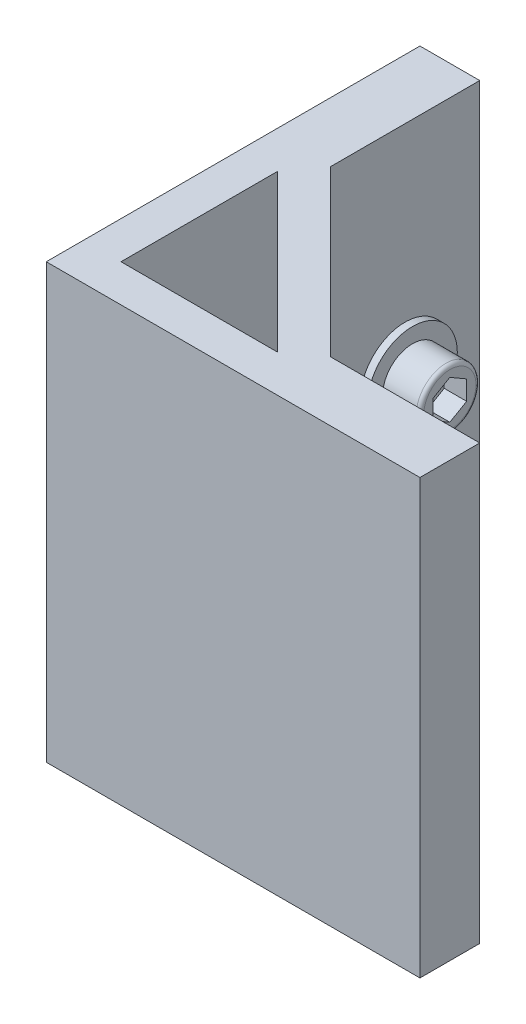
ISO-10303-21;
HEADER;
FILE_DESCRIPTION(('STEP AP214'),'2;1');
FILE_NAME('part.step','',(''),(''),'','','');
FILE_SCHEMA(('AUTOMOTIVE_DESIGN { 1 0 10303 214 1 1 1 1 }'));
ENDSEC;
DATA;
#1=APPLICATION_CONTEXT('core data for automotive mechanical design processes');
#2=APPLICATION_PROTOCOL_DEFINITION('international standard','automotive_design',2000,#1);
#3=PRODUCT_CONTEXT('',#1,'mechanical');
#4=PRODUCT('Part','Part','',(#3));
#5=PRODUCT_RELATED_PRODUCT_CATEGORY('part','',(#4));
#6=PRODUCT_DEFINITION_FORMATION('','',#4);
#7=PRODUCT_DEFINITION_CONTEXT('part definition',#1,'design');
#8=PRODUCT_DEFINITION('design','',#6,#7);
#9=PRODUCT_DEFINITION_SHAPE('','',#8);
#10=(LENGTH_UNIT() NAMED_UNIT(*) SI_UNIT(.MILLI.,.METRE.));
#11=(NAMED_UNIT(*) PLANE_ANGLE_UNIT() SI_UNIT($,.RADIAN.));
#12=(NAMED_UNIT(*) SI_UNIT($,.STERADIAN.) SOLID_ANGLE_UNIT());
#13=UNCERTAINTY_MEASURE_WITH_UNIT(LENGTH_MEASURE(1.E-05),#10,'distance_accuracy_value','');
#14=(GEOMETRIC_REPRESENTATION_CONTEXT(3) GLOBAL_UNCERTAINTY_ASSIGNED_CONTEXT((#13)) GLOBAL_UNIT_ASSIGNED_CONTEXT((#10,
#11,#12)) REPRESENTATION_CONTEXT('',''));
#15=CARTESIAN_POINT('',(0.,0.,0.));
#16=DIRECTION('',(0.,0.,1.));
#17=DIRECTION('',(1.,0.,0.));
#18=AXIS2_PLACEMENT_3D('',#15,#16,#17);
#19=CARTESIAN_POINT('',(0.,58.,0.));
#20=DIRECTION('',(0.,1.,0.));
#21=DIRECTION('',(0.,0.,1.));
#22=AXIS2_PLACEMENT_3D('',#19,#20,#21);
#23=PLANE('',#22);
#24=DIRECTION('',(-1.,0.,0.));
#25=VECTOR('',#24,1.);
#26=CARTESIAN_POINT('',(8.,58.,-50.));
#27=LINE('',#26,#25);
#28=CARTESIAN_POINT('',(8.,58.,-50.));
#29=VERTEX_POINT('',#28);
#30=CARTESIAN_POINT('',(0.,58.,-50.));
#31=VERTEX_POINT('',#30);
#32=EDGE_CURVE('E230',#29,#31,#27,.T.);
#33=ORIENTED_EDGE('',*,*,#32,.T.);
#34=DIRECTION('',(0.,0.,1.));
#35=VECTOR('',#34,1.);
#36=CARTESIAN_POINT('',(0.,58.,-50.));
#37=LINE('',#36,#35);
#38=CARTESIAN_POINT('',(0.,58.,0.));
#39=VERTEX_POINT('',#38);
#40=EDGE_CURVE('E233',#31,#39,#37,.T.);
#41=ORIENTED_EDGE('',*,*,#40,.T.);
#42=DIRECTION('',(1.,0.,0.));
#43=VECTOR('',#42,1.);
#44=CARTESIAN_POINT('',(0.,58.,0.));
#45=LINE('',#44,#43);
#46=CARTESIAN_POINT('',(50.,58.,0.));
#47=VERTEX_POINT('',#46);
#48=EDGE_CURVE('E236',#39,#47,#45,.T.);
#49=ORIENTED_EDGE('',*,*,#48,.T.);
#50=DIRECTION('',(0.,0.,-1.));
#51=VECTOR('',#50,1.);
#52=CARTESIAN_POINT('',(50.,58.,0.));
#53=LINE('',#52,#51);
#54=CARTESIAN_POINT('',(50.,58.,-8.));
#55=VERTEX_POINT('',#54);
#56=EDGE_CURVE('E238',#47,#55,#53,.T.);
#57=ORIENTED_EDGE('',*,*,#56,.T.);
#58=DIRECTION('',(-1.,0.,0.));
#59=VECTOR('',#58,1.);
#60=CARTESIAN_POINT('',(50.,58.,-8.));
#61=LINE('',#60,#59);
#62=CARTESIAN_POINT('',(30.,58.,-8.));
#63=VERTEX_POINT('',#62);
#64=EDGE_CURVE('E240',#55,#63,#61,.T.);
#65=ORIENTED_EDGE('',*,*,#64,.T.);
#66=DIRECTION('',(-0.707106781186548,0.,-0.707106781186548));
#67=VECTOR('',#66,1.);
#68=CARTESIAN_POINT('',(30.,58.,-8.));
#69=LINE('',#68,#67);
#70=CARTESIAN_POINT('',(8.,58.,-30.));
#71=VERTEX_POINT('',#70);
#72=EDGE_CURVE('E242',#63,#71,#69,.T.);
#73=ORIENTED_EDGE('',*,*,#72,.T.);
#74=DIRECTION('',(0.,0.,-1.));
#75=VECTOR('',#74,1.);
#76=CARTESIAN_POINT('',(8.,58.,-30.));
#77=LINE('',#76,#75);
#78=EDGE_CURVE('E244',#71,#29,#77,.T.);
#79=ORIENTED_EDGE('',*,*,#78,.T.);
#80=EDGE_LOOP('',(#33,#41,#49,#57,#65,#73,#79));
#81=FACE_BOUND('',#80,.T.);
#82=DIRECTION('',(1.,0.,0.));
#83=VECTOR('',#82,1.);
#84=CARTESIAN_POINT('',(25.9289321881345,58.,-5.));
#85=LINE('',#84,#83);
#86=CARTESIAN_POINT('',(5.,58.,-5.));
#87=VERTEX_POINT('',#86);
#88=CARTESIAN_POINT('',(25.9289321881345,58.,-5.));
#89=VERTEX_POINT('',#88);
#90=EDGE_CURVE('E210',#87,#89,#85,.T.);
#91=ORIENTED_EDGE('',*,*,#90,.F.);
#92=DIRECTION('',(0.,0.,1.));
#93=VECTOR('',#92,1.);
#94=CARTESIAN_POINT('',(5.,58.,-5.));
#95=LINE('',#94,#93);
#96=CARTESIAN_POINT('',(5.00000000000001,58.,-25.9289321881345));
#97=VERTEX_POINT('',#96);
#98=EDGE_CURVE('E208',#97,#87,#95,.T.);
#99=ORIENTED_EDGE('',*,*,#98,.F.);
#100=DIRECTION('',(-0.707106781186547,0.,-0.707106781186548));
#101=VECTOR('',#100,1.);
#102=CARTESIAN_POINT('',(5.00000000000001,58.,-25.9289321881345));
#103=LINE('',#102,#101);
#104=EDGE_CURVE('E213',#89,#97,#103,.T.);
#105=ORIENTED_EDGE('',*,*,#104,.F.);
#106=EDGE_LOOP('',(#91,#99,#105));
#107=FACE_BOUND('',#106,.T.);
#108=ADVANCED_FACE('F33',(#81,#107),#23,.T.);
#109=CARTESIAN_POINT('',(0.,0.,0.));
#110=DIRECTION('',(0.,1.,0.));
#111=DIRECTION('',(0.,0.,1.));
#112=AXIS2_PLACEMENT_3D('',#109,#110,#111);
#113=PLANE('',#112);
#114=DIRECTION('',(-1.,0.,0.));
#115=VECTOR('',#114,1.);
#116=CARTESIAN_POINT('',(8.,0.,-50.));
#117=LINE('',#116,#115);
#118=CARTESIAN_POINT('',(8.,0.,-50.));
#119=VERTEX_POINT('',#118);
#120=CARTESIAN_POINT('',(0.,0.,-50.));
#121=VERTEX_POINT('',#120);
#122=EDGE_CURVE('E229',#119,#121,#117,.T.);
#123=ORIENTED_EDGE('',*,*,#122,.F.);
#124=DIRECTION('',(0.,0.,-1.));
#125=VECTOR('',#124,1.);
#126=CARTESIAN_POINT('',(8.,0.,-30.));
#127=LINE('',#126,#125);
#128=CARTESIAN_POINT('',(8.,0.,-30.));
#129=VERTEX_POINT('',#128);
#130=EDGE_CURVE('E234',#129,#119,#127,.T.);
#131=ORIENTED_EDGE('',*,*,#130,.F.);
#132=DIRECTION('',(-0.707106781186548,0.,-0.707106781186548));
#133=VECTOR('',#132,1.);
#134=CARTESIAN_POINT('',(30.,0.,-8.));
#135=LINE('',#134,#133);
#136=CARTESIAN_POINT('',(30.,0.,-8.));
#137=VERTEX_POINT('',#136);
#138=EDGE_CURVE('E257',#137,#129,#135,.T.);
#139=ORIENTED_EDGE('',*,*,#138,.F.);
#140=DIRECTION('',(-1.,0.,0.));
#141=VECTOR('',#140,1.);
#142=CARTESIAN_POINT('',(50.,0.,-8.));
#143=LINE('',#142,#141);
#144=CARTESIAN_POINT('',(50.,0.,-8.));
#145=VERTEX_POINT('',#144);
#146=EDGE_CURVE('E255',#145,#137,#143,.T.);
#147=ORIENTED_EDGE('',*,*,#146,.F.);
#148=DIRECTION('',(0.,0.,-1.));
#149=VECTOR('',#148,1.);
#150=CARTESIAN_POINT('',(50.,0.,0.));
#151=LINE('',#150,#149);
#152=CARTESIAN_POINT('',(50.,0.,0.));
#153=VERTEX_POINT('',#152);
#154=EDGE_CURVE('E253',#153,#145,#151,.T.);
#155=ORIENTED_EDGE('',*,*,#154,.F.);
#156=DIRECTION('',(1.,0.,0.));
#157=VECTOR('',#156,1.);
#158=CARTESIAN_POINT('',(0.,0.,0.));
#159=LINE('',#158,#157);
#160=CARTESIAN_POINT('',(0.,0.,0.));
#161=VERTEX_POINT('',#160);
#162=EDGE_CURVE('E251',#161,#153,#159,.T.);
#163=ORIENTED_EDGE('',*,*,#162,.F.);
#164=DIRECTION('',(0.,0.,1.));
#165=VECTOR('',#164,1.);
#166=CARTESIAN_POINT('',(0.,0.,-50.));
#167=LINE('',#166,#165);
#168=EDGE_CURVE('E249',#121,#161,#167,.T.);
#169=ORIENTED_EDGE('',*,*,#168,.F.);
#170=EDGE_LOOP('',(#123,#131,#139,#147,#155,#163,#169));
#171=FACE_BOUND('',#170,.T.);
#172=DIRECTION('',(0.,0.,1.));
#173=VECTOR('',#172,1.);
#174=CARTESIAN_POINT('',(5.,0.,-5.));
#175=LINE('',#174,#173);
#176=CARTESIAN_POINT('',(5.00000000000001,0.,-25.9289321881345));
#177=VERTEX_POINT('',#176);
#178=CARTESIAN_POINT('',(5.,0.,-5.));
#179=VERTEX_POINT('',#178);
#180=EDGE_CURVE('E207',#177,#179,#175,.T.);
#181=ORIENTED_EDGE('',*,*,#180,.T.);
#182=DIRECTION('',(1.,0.,0.));
#183=VECTOR('',#182,1.);
#184=CARTESIAN_POINT('',(25.9289321881345,0.,-5.));
#185=LINE('',#184,#183);
#186=CARTESIAN_POINT('',(25.9289321881345,0.,-5.));
#187=VERTEX_POINT('',#186);
#188=EDGE_CURVE('E218',#179,#187,#185,.T.);
#189=ORIENTED_EDGE('',*,*,#188,.T.);
#190=DIRECTION('',(-0.707106781186547,0.,-0.707106781186548));
#191=VECTOR('',#190,1.);
#192=CARTESIAN_POINT('',(5.00000000000001,0.,-25.9289321881345));
#193=LINE('',#192,#191);
#194=EDGE_CURVE('E211',#187,#177,#193,.T.);
#195=ORIENTED_EDGE('',*,*,#194,.T.);
#196=EDGE_LOOP('',(#181,#189,#195));
#197=FACE_BOUND('',#196,.T.);
#198=ADVANCED_FACE('F295',(#171,#197),#113,.F.);
#199=CARTESIAN_POINT('',(8.,58.,-50.));
#200=DIRECTION('',(0.,0.,1.));
#201=DIRECTION('',(1.,0.,0.));
#202=AXIS2_PLACEMENT_3D('',#199,#200,#201);
#203=PLANE('',#202);
#204=ORIENTED_EDGE('',*,*,#122,.T.);
#205=DIRECTION('',(0.,-1.,0.));
#206=VECTOR('',#205,1.);
#207=CARTESIAN_POINT('',(0.,58.,-50.));
#208=LINE('',#207,#206);
#209=EDGE_CURVE('E277',#31,#121,#208,.T.);
#210=ORIENTED_EDGE('',*,*,#209,.F.);
#211=ORIENTED_EDGE('',*,*,#32,.F.);
#212=DIRECTION('',(0.,-1.,0.));
#213=VECTOR('',#212,1.);
#214=CARTESIAN_POINT('',(8.,58.,-50.));
#215=LINE('',#214,#213);
#216=EDGE_CURVE('E246',#29,#119,#215,.T.);
#217=ORIENTED_EDGE('',*,*,#216,.T.);
#218=EDGE_LOOP('',(#204,#210,#211,#217));
#219=FACE_BOUND('',#218,.T.);
#220=ADVANCED_FACE('F301',(#219),#203,.F.);
#221=CARTESIAN_POINT('',(0.,58.,-50.));
#222=DIRECTION('',(1.,0.,0.));
#223=DIRECTION('',(0.,0.,-1.));
#224=AXIS2_PLACEMENT_3D('',#221,#222,#223);
#225=PLANE('',#224);
#226=ORIENTED_EDGE('',*,*,#168,.T.);
#227=DIRECTION('',(0.,-1.,0.));
#228=VECTOR('',#227,1.);
#229=CARTESIAN_POINT('',(0.,58.,0.));
#230=LINE('',#229,#228);
#231=EDGE_CURVE('E274',#39,#161,#230,.T.);
#232=ORIENTED_EDGE('',*,*,#231,.F.);
#233=ORIENTED_EDGE('',*,*,#40,.F.);
#234=ORIENTED_EDGE('',*,*,#209,.T.);
#235=EDGE_LOOP('',(#226,#232,#233,#234));
#236=FACE_BOUND('',#235,.T.);
#237=ADVANCED_FACE('F328',(#236),#225,.F.);
#238=CARTESIAN_POINT('',(0.,58.,0.));
#239=DIRECTION('',(0.,0.,-1.));
#240=DIRECTION('',(-1.,0.,0.));
#241=AXIS2_PLACEMENT_3D('',#238,#239,#240);
#242=PLANE('',#241);
#243=ORIENTED_EDGE('',*,*,#162,.T.);
#244=DIRECTION('',(0.,-1.,0.));
#245=VECTOR('',#244,1.);
#246=CARTESIAN_POINT('',(50.,58.,0.));
#247=LINE('',#246,#245);
#248=EDGE_CURVE('E271',#47,#153,#247,.T.);
#249=ORIENTED_EDGE('',*,*,#248,.F.);
#250=ORIENTED_EDGE('',*,*,#48,.F.);
#251=ORIENTED_EDGE('',*,*,#231,.T.);
#252=EDGE_LOOP('',(#243,#249,#250,#251));
#253=FACE_BOUND('',#252,.T.);
#254=ADVANCED_FACE('F324',(#253),#242,.F.);
#255=CARTESIAN_POINT('',(50.,58.,0.));
#256=DIRECTION('',(-1.,0.,0.));
#257=DIRECTION('',(0.,0.,1.));
#258=AXIS2_PLACEMENT_3D('',#255,#256,#257);
#259=PLANE('',#258);
#260=ORIENTED_EDGE('',*,*,#154,.T.);
#261=DIRECTION('',(0.,-1.,0.));
#262=VECTOR('',#261,1.);
#263=CARTESIAN_POINT('',(50.,58.,-8.));
#264=LINE('',#263,#262);
#265=EDGE_CURVE('E268',#55,#145,#264,.T.);
#266=ORIENTED_EDGE('',*,*,#265,.F.);
#267=ORIENTED_EDGE('',*,*,#56,.F.);
#268=ORIENTED_EDGE('',*,*,#248,.T.);
#269=EDGE_LOOP('',(#260,#266,#267,#268));
#270=FACE_BOUND('',#269,.T.);
#271=ADVANCED_FACE('F320',(#270),#259,.F.);
#272=CARTESIAN_POINT('',(50.,58.,-8.));
#273=DIRECTION('',(0.,0.,1.));
#274=DIRECTION('',(1.,0.,0.));
#275=AXIS2_PLACEMENT_3D('',#272,#273,#274);
#276=PLANE('',#275);
#277=ORIENTED_EDGE('',*,*,#146,.T.);
#278=DIRECTION('',(0.,-1.,0.));
#279=VECTOR('',#278,1.);
#280=CARTESIAN_POINT('',(30.,58.,-8.));
#281=LINE('',#280,#279);
#282=EDGE_CURVE('E265',#63,#137,#281,.T.);
#283=ORIENTED_EDGE('',*,*,#282,.F.);
#284=ORIENTED_EDGE('',*,*,#64,.F.);
#285=ORIENTED_EDGE('',*,*,#265,.T.);
#286=EDGE_LOOP('',(#277,#283,#284,#285));
#287=FACE_BOUND('',#286,.T.);
#288=ADVANCED_FACE('F316',(#287),#276,.F.);
#289=CARTESIAN_POINT('',(30.,58.,-8.));
#290=DIRECTION('',(-0.707106781186548,0.,0.707106781186548));
#291=DIRECTION('',(0.707106781186547,0.,0.707106781186548));
#292=AXIS2_PLACEMENT_3D('',#289,#290,#291);
#293=PLANE('',#292);
#294=ORIENTED_EDGE('',*,*,#138,.T.);
#295=DIRECTION('',(0.,-1.,0.));
#296=VECTOR('',#295,1.);
#297=CARTESIAN_POINT('',(8.,58.,-30.));
#298=LINE('',#297,#296);
#299=EDGE_CURVE('E262',#71,#129,#298,.T.);
#300=ORIENTED_EDGE('',*,*,#299,.F.);
#301=ORIENTED_EDGE('',*,*,#72,.F.);
#302=ORIENTED_EDGE('',*,*,#282,.T.);
#303=EDGE_LOOP('',(#294,#300,#301,#302));
#304=FACE_BOUND('',#303,.T.);
#305=ADVANCED_FACE('F312',(#304),#293,.F.);
#306=CARTESIAN_POINT('',(8.,58.,-30.));
#307=DIRECTION('',(-1.,0.,0.));
#308=DIRECTION('',(0.,0.,1.));
#309=AXIS2_PLACEMENT_3D('',#306,#307,#308);
#310=PLANE('',#309);
#311=CARTESIAN_POINT('',(8.,29.,-40.));
#312=DIRECTION('',(-1.,0.,0.));
#313=DIRECTION('',(0.,0.,1.));
#314=AXIS2_PLACEMENT_3D('',#311,#312,#313);
#315=CIRCLE('',#314,6.);
#316=CARTESIAN_POINT('',(8.,29.,-34.));
#317=VERTEX_POINT('',#316);
#318=EDGE_CURVE('E204',#317,#317,#315,.F.);
#319=ORIENTED_EDGE('',*,*,#318,.F.);
#320=EDGE_LOOP('',(#319));
#321=FACE_BOUND('',#320,.T.);
#322=ORIENTED_EDGE('',*,*,#130,.T.);
#323=ORIENTED_EDGE('',*,*,#216,.F.);
#324=ORIENTED_EDGE('',*,*,#78,.F.);
#325=ORIENTED_EDGE('',*,*,#299,.T.);
#326=EDGE_LOOP('',(#322,#323,#324,#325));
#327=FACE_BOUND('',#326,.T.);
#328=ADVANCED_FACE('F309',(#321,#327),#310,.F.);
#329=CARTESIAN_POINT('',(5.,58.,-5.));
#330=DIRECTION('',(1.,0.,0.));
#331=DIRECTION('',(0.,0.,-1.));
#332=AXIS2_PLACEMENT_3D('',#329,#330,#331);
#333=PLANE('',#332);
#334=ORIENTED_EDGE('',*,*,#180,.F.);
#335=DIRECTION('',(0.,-1.,0.));
#336=VECTOR('',#335,1.);
#337=CARTESIAN_POINT('',(5.00000000000001,58.,-25.9289321881345));
#338=LINE('',#337,#336);
#339=EDGE_CURVE('E215',#97,#177,#338,.T.);
#340=ORIENTED_EDGE('',*,*,#339,.F.);
#341=ORIENTED_EDGE('',*,*,#98,.T.);
#342=DIRECTION('',(0.,-1.,0.));
#343=VECTOR('',#342,1.);
#344=CARTESIAN_POINT('',(5.,58.,-5.));
#345=LINE('',#344,#343);
#346=EDGE_CURVE('E226',#87,#179,#345,.T.);
#347=ORIENTED_EDGE('',*,*,#346,.T.);
#348=EDGE_LOOP('',(#334,#340,#341,#347));
#349=FACE_BOUND('',#348,.T.);
#350=ADVANCED_FACE('F306',(#349),#333,.T.);
#351=CARTESIAN_POINT('',(25.9289321881345,58.,-5.));
#352=DIRECTION('',(0.,0.,-1.));
#353=DIRECTION('',(-1.,0.,0.));
#354=AXIS2_PLACEMENT_3D('',#351,#352,#353);
#355=PLANE('',#354);
#356=ORIENTED_EDGE('',*,*,#188,.F.);
#357=ORIENTED_EDGE('',*,*,#346,.F.);
#358=ORIENTED_EDGE('',*,*,#90,.T.);
#359=DIRECTION('',(0.,-1.,0.));
#360=VECTOR('',#359,1.);
#361=CARTESIAN_POINT('',(25.9289321881345,58.,-5.));
#362=LINE('',#361,#360);
#363=EDGE_CURVE('E56',#89,#187,#362,.T.);
#364=ORIENTED_EDGE('',*,*,#363,.T.);
#365=EDGE_LOOP('',(#356,#357,#358,#364));
#366=FACE_BOUND('',#365,.T.);
#367=ADVANCED_FACE('F365',(#366),#355,.T.);
#368=CARTESIAN_POINT('',(5.00000000000001,58.,-25.9289321881345));
#369=DIRECTION('',(-0.707106781186548,0.,0.707106781186547));
#370=DIRECTION('',(0.707106781186547,0.,0.707106781186548));
#371=AXIS2_PLACEMENT_3D('',#368,#369,#370);
#372=PLANE('',#371);
#373=ORIENTED_EDGE('',*,*,#194,.F.);
#374=ORIENTED_EDGE('',*,*,#363,.F.);
#375=ORIENTED_EDGE('',*,*,#104,.T.);
#376=ORIENTED_EDGE('',*,*,#339,.T.);
#377=EDGE_LOOP('',(#373,#374,#375,#376));
#378=FACE_BOUND('',#377,.T.);
#379=ADVANCED_FACE('F361',(#378),#372,.T.);
#380=CARTESIAN_POINT('',(9.,29.,-40.));
#381=DIRECTION('',(-1.,0.,0.));
#382=DIRECTION('',(0.,0.,1.));
#383=AXIS2_PLACEMENT_3D('',#380,#381,#382);
#384=CYLINDRICAL_SURFACE('',#383,6.);
#385=CARTESIAN_POINT('',(9.,29.,-40.));
#386=DIRECTION('',(1.,0.,0.));
#387=DIRECTION('',(0.,0.,-1.));
#388=AXIS2_PLACEMENT_3D('',#385,#386,#387);
#389=CIRCLE('',#388,6.);
#390=CARTESIAN_POINT('',(9.,29.,-46.));
#391=VERTEX_POINT('',#390);
#392=EDGE_CURVE('E193',#391,#391,#389,.T.);
#393=ORIENTED_EDGE('',*,*,#392,.F.);
#394=EDGE_LOOP('',(#393));
#395=FACE_BOUND('',#394,.T.);
#396=ORIENTED_EDGE('',*,*,#318,.T.);
#397=EDGE_LOOP('',(#396));
#398=FACE_BOUND('',#397,.T.);
#399=ADVANCED_FACE('F371',(#395,#398),#384,.T.);
#400=CARTESIAN_POINT('',(9.,29.,-40.));
#401=DIRECTION('',(1.,0.,0.));
#402=DIRECTION('',(0.,0.,-1.));
#403=AXIS2_PLACEMENT_3D('',#400,#401,#402);
#404=PLANE('',#403);
#405=CARTESIAN_POINT('',(9.,29.,-40.));
#406=DIRECTION('',(1.,0.,0.));
#407=DIRECTION('',(0.,0.,-1.));
#408=AXIS2_PLACEMENT_3D('',#405,#406,#407);
#409=CIRCLE('',#408,4.);
#410=CARTESIAN_POINT('',(9.,29.,-44.));
#411=VERTEX_POINT('',#410);
#412=EDGE_CURVE('E201',#411,#411,#409,.T.);
#413=ORIENTED_EDGE('',*,*,#412,.F.);
#414=EDGE_LOOP('',(#413));
#415=FACE_BOUND('',#414,.T.);
#416=ORIENTED_EDGE('',*,*,#392,.T.);
#417=EDGE_LOOP('',(#416));
#418=FACE_BOUND('',#417,.T.);
#419=ADVANCED_FACE('F376',(#415,#418),#404,.T.);
#420=CARTESIAN_POINT('',(14.,29.,-40.));
#421=DIRECTION('',(-1.,0.,0.));
#422=DIRECTION('',(0.,0.,1.));
#423=AXIS2_PLACEMENT_3D('',#420,#421,#422);
#424=CYLINDRICAL_SURFACE('',#423,4.);
#425=CARTESIAN_POINT('',(13.5,29.,-40.));
#426=DIRECTION('',(1.,0.,0.));
#427=DIRECTION('',(0.,0.,-1.));
#428=AXIS2_PLACEMENT_3D('',#425,#426,#427);
#429=CIRCLE('',#428,4.);
#430=CARTESIAN_POINT('',(13.5,29.,-44.));
#431=VERTEX_POINT('',#430);
#432=EDGE_CURVE('E11',#431,#431,#429,.F.);
#433=ORIENTED_EDGE('',*,*,#432,.T.);
#434=EDGE_LOOP('',(#433));
#435=FACE_BOUND('',#434,.T.);
#436=ORIENTED_EDGE('',*,*,#412,.T.);
#437=EDGE_LOOP('',(#436));
#438=FACE_BOUND('',#437,.T.);
#439=ADVANCED_FACE('F380',(#435,#438),#424,.T.);
#440=CARTESIAN_POINT('',(14.,29.,-40.));
#441=DIRECTION('',(1.,0.,0.));
#442=DIRECTION('',(0.,0.,-1.));
#443=AXIS2_PLACEMENT_3D('',#440,#441,#442);
#444=PLANE('',#443);
#445=CARTESIAN_POINT('',(14.,29.,-40.));
#446=DIRECTION('',(1.,0.,0.));
#447=DIRECTION('',(0.,0.,-1.));
#448=AXIS2_PLACEMENT_3D('',#445,#446,#447);
#449=CIRCLE('',#448,3.5);
#450=CARTESIAN_POINT('',(14.,29.,-43.5));
#451=VERTEX_POINT('',#450);
#452=EDGE_CURVE('E41',#451,#451,#449,.T.);
#453=ORIENTED_EDGE('',*,*,#452,.T.);
#454=EDGE_LOOP('',(#453));
#455=FACE_BOUND('',#454,.T.);
#456=DIRECTION('',(0.,-0.5,-0.866025403784438));
#457=VECTOR('',#456,1.);
#458=CARTESIAN_POINT('',(14.,27.7009618943234,-37.75));
#459=LINE('',#458,#457);
#460=CARTESIAN_POINT('',(14.,27.7009618943234,-37.75));
#461=VERTEX_POINT('',#460);
#462=CARTESIAN_POINT('',(14.,26.4019237886467,-40.));
#463=VERTEX_POINT('',#462);
#464=EDGE_CURVE('E48',#461,#463,#459,.T.);
#465=ORIENTED_EDGE('',*,*,#464,.F.);
#466=DIRECTION('',(0.,-1.,0.));
#467=VECTOR('',#466,1.);
#468=CARTESIAN_POINT('',(14.,30.2990381056767,-37.75));
#469=LINE('',#468,#467);
#470=CARTESIAN_POINT('',(14.,30.2990381056767,-37.75));
#471=VERTEX_POINT('',#470);
#472=EDGE_CURVE('E167',#471,#461,#469,.T.);
#473=ORIENTED_EDGE('',*,*,#472,.F.);
#474=DIRECTION('',(0.,-0.500000000000001,0.866025403784438));
#475=VECTOR('',#474,1.);
#476=CARTESIAN_POINT('',(14.,31.5980762113533,-40.));
#477=LINE('',#476,#475);
#478=CARTESIAN_POINT('',(14.,31.5980762113533,-40.));
#479=VERTEX_POINT('',#478);
#480=EDGE_CURVE('E170',#479,#471,#477,.T.);
#481=ORIENTED_EDGE('',*,*,#480,.F.);
#482=DIRECTION('',(0.,0.5,0.866025403784438));
#483=VECTOR('',#482,1.);
#484=CARTESIAN_POINT('',(14.,30.2990381056767,-42.25));
#485=LINE('',#484,#483);
#486=CARTESIAN_POINT('',(14.,30.2990381056767,-42.25));
#487=VERTEX_POINT('',#486);
#488=EDGE_CURVE('E186',#487,#479,#485,.T.);
#489=ORIENTED_EDGE('',*,*,#488,.F.);
#490=DIRECTION('',(0.,1.,0.));
#491=VECTOR('',#490,1.);
#492=CARTESIAN_POINT('',(14.,27.7009618943234,-42.25));
#493=LINE('',#492,#491);
#494=CARTESIAN_POINT('',(14.,27.7009618943234,-42.25));
#495=VERTEX_POINT('',#494);
#496=EDGE_CURVE('E183',#495,#487,#493,.T.);
#497=ORIENTED_EDGE('',*,*,#496,.F.);
#498=DIRECTION('',(0.,0.500000000000001,-0.866025403784438));
#499=VECTOR('',#498,1.);
#500=CARTESIAN_POINT('',(14.,26.4019237886467,-40.));
#501=LINE('',#500,#499);
#502=EDGE_CURVE('E181',#463,#495,#501,.T.);
#503=ORIENTED_EDGE('',*,*,#502,.F.);
#504=EDGE_LOOP('',(#465,#473,#481,#489,#497,#503));
#505=FACE_BOUND('',#504,.T.);
#506=ADVANCED_FACE('F284',(#455,#505),#444,.T.);
#507=CARTESIAN_POINT('',(11.,27.7009618943234,-37.75));
#508=DIRECTION('',(0.,-0.866025403784438,0.500000000000001));
#509=DIRECTION('',(0.,-0.500000000000001,-0.866025403784438));
#510=AXIS2_PLACEMENT_3D('',#507,#508,#509);
#511=PLANE('',#510);
#512=ORIENTED_EDGE('',*,*,#464,.T.);
#513=DIRECTION('',(1.,0.,0.));
#514=VECTOR('',#513,1.);
#515=CARTESIAN_POINT('',(11.,26.4019237886467,-40.));
#516=LINE('',#515,#514);
#517=CARTESIAN_POINT('',(11.,26.4019237886467,-40.));
#518=VERTEX_POINT('',#517);
#519=EDGE_CURVE('E144',#518,#463,#516,.T.);
#520=ORIENTED_EDGE('',*,*,#519,.F.);
#521=DIRECTION('',(0.,-0.5,-0.866025403784438));
#522=VECTOR('',#521,1.);
#523=CARTESIAN_POINT('',(11.,27.7009618943234,-37.75));
#524=LINE('',#523,#522);
#525=CARTESIAN_POINT('',(11.,27.7009618943234,-37.75));
#526=VERTEX_POINT('',#525);
#527=EDGE_CURVE('E148',#526,#518,#524,.T.);
#528=ORIENTED_EDGE('',*,*,#527,.F.);
#529=DIRECTION('',(1.,0.,0.));
#530=VECTOR('',#529,1.);
#531=CARTESIAN_POINT('',(11.,27.7009618943234,-37.75));
#532=LINE('',#531,#530);
#533=EDGE_CURVE('E191',#526,#461,#532,.T.);
#534=ORIENTED_EDGE('',*,*,#533,.T.);
#535=EDGE_LOOP('',(#512,#520,#528,#534));
#536=FACE_BOUND('',#535,.T.);
#537=ADVANCED_FACE('F146',(#536),#511,.F.);
#538=CARTESIAN_POINT('',(11.,30.2990381056767,-37.75));
#539=DIRECTION('',(0.,0.,1.));
#540=DIRECTION('',(1.,0.,0.));
#541=AXIS2_PLACEMENT_3D('',#538,#539,#540);
#542=PLANE('',#541);
#543=ORIENTED_EDGE('',*,*,#472,.T.);
#544=ORIENTED_EDGE('',*,*,#533,.F.);
#545=DIRECTION('',(0.,-1.,0.));
#546=VECTOR('',#545,1.);
#547=CARTESIAN_POINT('',(11.,30.2990381056767,-37.75));
#548=LINE('',#547,#546);
#549=CARTESIAN_POINT('',(11.,30.2990381056767,-37.75));
#550=VERTEX_POINT('',#549);
#551=EDGE_CURVE('E154',#550,#526,#548,.T.);
#552=ORIENTED_EDGE('',*,*,#551,.F.);
#553=DIRECTION('',(1.,0.,0.));
#554=VECTOR('',#553,1.);
#555=CARTESIAN_POINT('',(11.,30.2990381056767,-37.75));
#556=LINE('',#555,#554);
#557=EDGE_CURVE('E194',#550,#471,#556,.T.);
#558=ORIENTED_EDGE('',*,*,#557,.T.);
#559=EDGE_LOOP('',(#543,#544,#552,#558));
#560=FACE_BOUND('',#559,.T.);
#561=ADVANCED_FACE('F389',(#560),#542,.F.);
#562=CARTESIAN_POINT('',(11.,31.5980762113533,-40.));
#563=DIRECTION('',(0.,0.866025403784438,0.500000000000001));
#564=DIRECTION('',(0.,-0.500000000000001,0.866025403784438));
#565=AXIS2_PLACEMENT_3D('',#562,#563,#564);
#566=PLANE('',#565);
#567=ORIENTED_EDGE('',*,*,#480,.T.);
#568=ORIENTED_EDGE('',*,*,#557,.F.);
#569=DIRECTION('',(0.,-0.500000000000001,0.866025403784438));
#570=VECTOR('',#569,1.);
#571=CARTESIAN_POINT('',(11.,31.5980762113533,-40.));
#572=LINE('',#571,#570);
#573=CARTESIAN_POINT('',(11.,31.5980762113533,-40.));
#574=VERTEX_POINT('',#573);
#575=EDGE_CURVE('E177',#574,#550,#572,.T.);
#576=ORIENTED_EDGE('',*,*,#575,.F.);
#577=DIRECTION('',(1.,0.,0.));
#578=VECTOR('',#577,1.);
#579=CARTESIAN_POINT('',(11.,31.5980762113533,-40.));
#580=LINE('',#579,#578);
#581=EDGE_CURVE('E196',#574,#479,#580,.T.);
#582=ORIENTED_EDGE('',*,*,#581,.T.);
#583=EDGE_LOOP('',(#567,#568,#576,#582));
#584=FACE_BOUND('',#583,.T.);
#585=ADVANCED_FACE('F399',(#584),#566,.F.);
#586=CARTESIAN_POINT('',(11.,30.2990381056767,-42.25));
#587=DIRECTION('',(0.,0.866025403784438,-0.500000000000001));
#588=DIRECTION('',(0.,0.500000000000001,0.866025403784438));
#589=AXIS2_PLACEMENT_3D('',#586,#587,#588);
#590=PLANE('',#589);
#591=ORIENTED_EDGE('',*,*,#488,.T.);
#592=ORIENTED_EDGE('',*,*,#581,.F.);
#593=DIRECTION('',(0.,0.5,0.866025403784438));
#594=VECTOR('',#593,1.);
#595=CARTESIAN_POINT('',(11.,30.2990381056767,-42.25));
#596=LINE('',#595,#594);
#597=CARTESIAN_POINT('',(11.,30.2990381056767,-42.25));
#598=VERTEX_POINT('',#597);
#599=EDGE_CURVE('E174',#598,#574,#596,.T.);
#600=ORIENTED_EDGE('',*,*,#599,.F.);
#601=DIRECTION('',(1.,0.,0.));
#602=VECTOR('',#601,1.);
#603=CARTESIAN_POINT('',(11.,30.2990381056767,-42.25));
#604=LINE('',#603,#602);
#605=EDGE_CURVE('E198',#598,#487,#604,.T.);
#606=ORIENTED_EDGE('',*,*,#605,.T.);
#607=EDGE_LOOP('',(#591,#592,#600,#606));
#608=FACE_BOUND('',#607,.T.);
#609=ADVANCED_FACE('F395',(#608),#590,.F.);
#610=CARTESIAN_POINT('',(11.,27.7009618943234,-42.25));
#611=DIRECTION('',(0.,0.,-1.));
#612=DIRECTION('',(-1.,0.,0.));
#613=AXIS2_PLACEMENT_3D('',#610,#611,#612);
#614=PLANE('',#613);
#615=ORIENTED_EDGE('',*,*,#496,.T.);
#616=ORIENTED_EDGE('',*,*,#605,.F.);
#617=DIRECTION('',(0.,1.,0.));
#618=VECTOR('',#617,1.);
#619=CARTESIAN_POINT('',(11.,27.7009618943234,-42.25));
#620=LINE('',#619,#618);
#621=CARTESIAN_POINT('',(11.,27.7009618943234,-42.25));
#622=VERTEX_POINT('',#621);
#623=EDGE_CURVE('E162',#622,#598,#620,.T.);
#624=ORIENTED_EDGE('',*,*,#623,.F.);
#625=DIRECTION('',(1.,0.,0.));
#626=VECTOR('',#625,1.);
#627=CARTESIAN_POINT('',(11.,27.7009618943234,-42.25));
#628=LINE('',#627,#626);
#629=EDGE_CURVE('E153',#622,#495,#628,.T.);
#630=ORIENTED_EDGE('',*,*,#629,.T.);
#631=EDGE_LOOP('',(#615,#616,#624,#630));
#632=FACE_BOUND('',#631,.T.);
#633=ADVANCED_FACE('F392',(#632),#614,.F.);
#634=CARTESIAN_POINT('',(11.,26.4019237886467,-40.));
#635=DIRECTION('',(0.,-0.866025403784438,-0.500000000000001));
#636=DIRECTION('',(0.,0.500000000000001,-0.866025403784438));
#637=AXIS2_PLACEMENT_3D('',#634,#635,#636);
#638=PLANE('',#637);
#639=ORIENTED_EDGE('',*,*,#502,.T.);
#640=ORIENTED_EDGE('',*,*,#629,.F.);
#641=DIRECTION('',(0.,0.500000000000001,-0.866025403784438));
#642=VECTOR('',#641,1.);
#643=CARTESIAN_POINT('',(11.,26.4019237886467,-40.));
#644=LINE('',#643,#642);
#645=EDGE_CURVE('E157',#518,#622,#644,.T.);
#646=ORIENTED_EDGE('',*,*,#645,.F.);
#647=ORIENTED_EDGE('',*,*,#519,.T.);
#648=EDGE_LOOP('',(#639,#640,#646,#647));
#649=FACE_BOUND('',#648,.T.);
#650=ADVANCED_FACE('F158',(#649),#638,.F.);
#651=CARTESIAN_POINT('',(11.,0.,0.));
#652=DIRECTION('',(1.,0.,0.));
#653=DIRECTION('',(0.,0.,-1.));
#654=AXIS2_PLACEMENT_3D('',#651,#652,#653);
#655=PLANE('',#654);
#656=ORIENTED_EDGE('',*,*,#527,.T.);
#657=ORIENTED_EDGE('',*,*,#645,.T.);
#658=ORIENTED_EDGE('',*,*,#623,.T.);
#659=ORIENTED_EDGE('',*,*,#599,.T.);
#660=ORIENTED_EDGE('',*,*,#575,.T.);
#661=ORIENTED_EDGE('',*,*,#551,.T.);
#662=EDGE_LOOP('',(#656,#657,#658,#659,#660,#661));
#663=FACE_BOUND('',#662,.T.);
#664=ADVANCED_FACE('F164',(#663),#655,.T.);
#665=CARTESIAN_POINT('',(13.5,29.,-40.));
#666=DIRECTION('',(1.,0.,0.));
#667=DIRECTION('',(0.,0.,-1.));
#668=AXIS2_PLACEMENT_3D('',#665,#666,#667);
#669=TOROIDAL_SURFACE('',#668,3.5,0.5);
#670=ORIENTED_EDGE('',*,*,#432,.F.);
#671=EDGE_LOOP('',(#670));
#672=FACE_BOUND('',#671,.T.);
#673=ORIENTED_EDGE('',*,*,#452,.F.);
#674=EDGE_LOOP('',(#673));
#675=FACE_BOUND('',#674,.T.);
#676=ADVANCED_FACE('F35',(#672,#675),#669,.T.);
#677=CLOSED_SHELL('',(#108,#198,#220,#237,#254,#271,#288,#305,#328,#350,#367,#379,#399,#419,
#439,#506,#537,#561,#585,#609,#633,#650,#664,#676));
#678=MANIFOLD_SOLID_BREP('B2',#677);
#679=ADVANCED_BREP_SHAPE_REPRESENTATION('',(#18,#678),#14);
#680=SHAPE_DEFINITION_REPRESENTATION(#9,#679);
ENDSEC;
END-ISO-10303-21;
